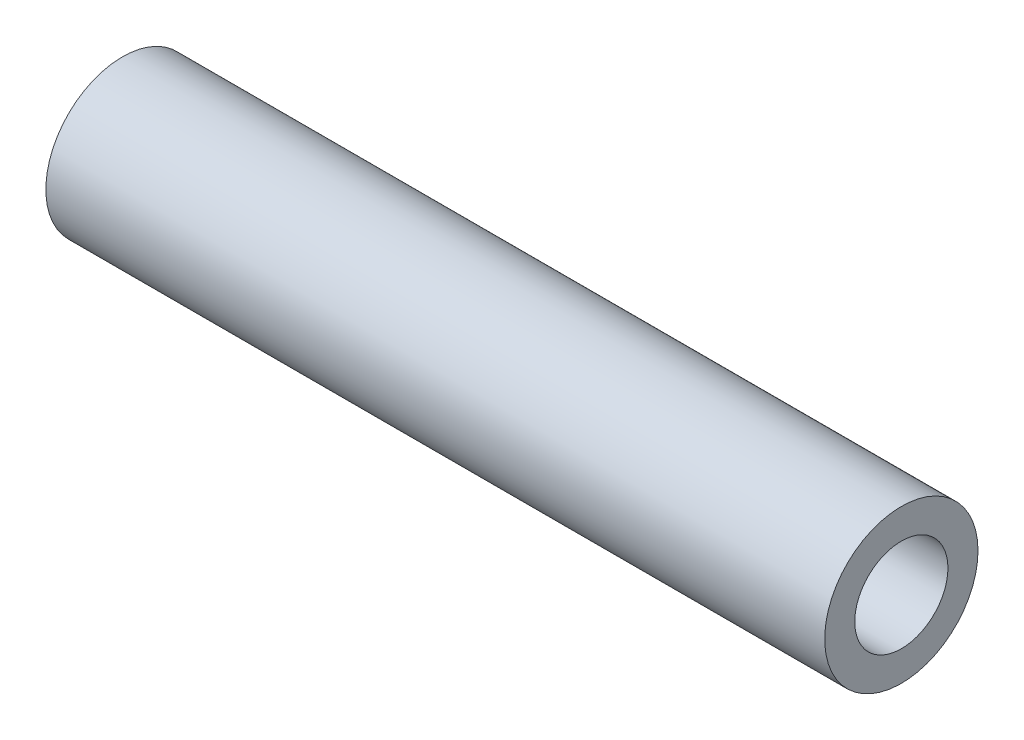
ISO-10303-21;
HEADER;
FILE_DESCRIPTION(('STEP AP214'),'2;1');
FILE_NAME('part.step','',(''),(''),'','','');
FILE_SCHEMA(('AUTOMOTIVE_DESIGN { 1 0 10303 214 1 1 1 1 }'));
ENDSEC;
DATA;
#1=APPLICATION_CONTEXT('core data for automotive mechanical design processes');
#2=APPLICATION_PROTOCOL_DEFINITION('international standard','automotive_design',2000,#1);
#3=PRODUCT_CONTEXT('',#1,'mechanical');
#4=PRODUCT('Part','Part','',(#3));
#5=PRODUCT_RELATED_PRODUCT_CATEGORY('part','',(#4));
#6=PRODUCT_DEFINITION_FORMATION('','',#4);
#7=PRODUCT_DEFINITION_CONTEXT('part definition',#1,'design');
#8=PRODUCT_DEFINITION('design','',#6,#7);
#9=PRODUCT_DEFINITION_SHAPE('','',#8);
#10=(LENGTH_UNIT() NAMED_UNIT(*) SI_UNIT(.MILLI.,.METRE.));
#11=(NAMED_UNIT(*) PLANE_ANGLE_UNIT() SI_UNIT($,.RADIAN.));
#12=(NAMED_UNIT(*) SI_UNIT($,.STERADIAN.) SOLID_ANGLE_UNIT());
#13=UNCERTAINTY_MEASURE_WITH_UNIT(LENGTH_MEASURE(1.E-05),#10,'distance_accuracy_value','');
#14=(GEOMETRIC_REPRESENTATION_CONTEXT(3) GLOBAL_UNCERTAINTY_ASSIGNED_CONTEXT((#13)) GLOBAL_UNIT_ASSIGNED_CONTEXT((#10,
#11,#12)) REPRESENTATION_CONTEXT('',''));
#15=CARTESIAN_POINT('',(0.,0.,0.));
#16=DIRECTION('',(0.,0.,1.));
#17=DIRECTION('',(1.,0.,0.));
#18=AXIS2_PLACEMENT_3D('',#15,#16,#17);
#19=CARTESIAN_POINT('',(16.129,0.,0.));
#20=DIRECTION('',(1.,0.,0.));
#21=DIRECTION('',(0.,0.,-1.));
#22=AXIS2_PLACEMENT_3D('',#19,#20,#21);
#23=PLANE('',#22);
#24=CARTESIAN_POINT('',(16.129,0.,0.));
#25=DIRECTION('',(1.,0.,0.));
#26=DIRECTION('',(0.,0.,-1.));
#27=AXIS2_PLACEMENT_3D('',#24,#25,#26);
#28=CIRCLE('',#27,3.175);
#29=CARTESIAN_POINT('',(16.129,0.,-3.175));
#30=VERTEX_POINT('',#29);
#31=EDGE_CURVE('E10',#30,#30,#28,.T.);
#32=ORIENTED_EDGE('',*,*,#31,.T.);
#33=EDGE_LOOP('',(#32));
#34=FACE_BOUND('',#33,.T.);
#35=CARTESIAN_POINT('',(16.129,0.,0.));
#36=DIRECTION('',(1.,0.,0.));
#37=DIRECTION('',(0.,0.,-1.));
#38=AXIS2_PLACEMENT_3D('',#35,#36,#37);
#39=CIRCLE('',#38,1.9304);
#40=CARTESIAN_POINT('',(16.129,0.,-1.9304));
#41=VERTEX_POINT('',#40);
#42=EDGE_CURVE('E48',#41,#41,#39,.T.);
#43=ORIENTED_EDGE('',*,*,#42,.F.);
#44=EDGE_LOOP('',(#43));
#45=FACE_BOUND('',#44,.T.);
#46=ADVANCED_FACE('F37',(#34,#45),#23,.T.);
#47=CARTESIAN_POINT('',(-16.129,0.,0.));
#48=DIRECTION('',(1.,0.,0.));
#49=DIRECTION('',(0.,0.,-1.));
#50=AXIS2_PLACEMENT_3D('',#47,#48,#49);
#51=PLANE('',#50);
#52=CARTESIAN_POINT('',(-16.129,0.,0.));
#53=DIRECTION('',(1.,0.,0.));
#54=DIRECTION('',(0.,0.,-1.));
#55=AXIS2_PLACEMENT_3D('',#52,#53,#54);
#56=CIRCLE('',#55,3.175);
#57=CARTESIAN_POINT('',(-16.129,0.,-3.175));
#58=VERTEX_POINT('',#57);
#59=EDGE_CURVE('E41',#58,#58,#56,.T.);
#60=ORIENTED_EDGE('',*,*,#59,.F.);
#61=EDGE_LOOP('',(#60));
#62=FACE_BOUND('',#61,.T.);
#63=CARTESIAN_POINT('',(-16.129,0.,0.));
#64=DIRECTION('',(1.,0.,0.));
#65=DIRECTION('',(0.,0.,-1.));
#66=AXIS2_PLACEMENT_3D('',#63,#64,#65);
#67=CIRCLE('',#66,1.9304);
#68=CARTESIAN_POINT('',(-16.129,0.,-1.9304));
#69=VERTEX_POINT('',#68);
#70=EDGE_CURVE('E50',#69,#69,#67,.T.);
#71=ORIENTED_EDGE('',*,*,#70,.T.);
#72=EDGE_LOOP('',(#71));
#73=FACE_BOUND('',#72,.T.);
#74=ADVANCED_FACE('F60',(#62,#73),#51,.F.);
#75=CARTESIAN_POINT('',(16.129,0.,0.));
#76=DIRECTION('',(-1.,0.,0.));
#77=DIRECTION('',(0.,0.,1.));
#78=AXIS2_PLACEMENT_3D('',#75,#76,#77);
#79=CYLINDRICAL_SURFACE('',#78,3.175);
#80=ORIENTED_EDGE('',*,*,#31,.F.);
#81=EDGE_LOOP('',(#80));
#82=FACE_BOUND('',#81,.T.);
#83=ORIENTED_EDGE('',*,*,#59,.T.);
#84=EDGE_LOOP('',(#83));
#85=FACE_BOUND('',#84,.T.);
#86=ADVANCED_FACE('F39',(#82,#85),#79,.T.);
#87=CARTESIAN_POINT('',(16.129,0.,0.));
#88=DIRECTION('',(-1.,0.,0.));
#89=DIRECTION('',(0.,0.,1.));
#90=AXIS2_PLACEMENT_3D('',#87,#88,#89);
#91=CYLINDRICAL_SURFACE('',#90,1.9304);
#92=ORIENTED_EDGE('',*,*,#42,.T.);
#93=EDGE_LOOP('',(#92));
#94=FACE_BOUND('',#93,.T.);
#95=ORIENTED_EDGE('',*,*,#70,.F.);
#96=EDGE_LOOP('',(#95));
#97=FACE_BOUND('',#96,.T.);
#98=ADVANCED_FACE('F56',(#94,#97),#91,.F.);
#99=CLOSED_SHELL('',(#46,#74,#86,#98));
#100=MANIFOLD_SOLID_BREP('B2',#99);
#101=ADVANCED_BREP_SHAPE_REPRESENTATION('',(#18,#100),#14);
#102=SHAPE_DEFINITION_REPRESENTATION(#9,#101);
ENDSEC;
END-ISO-10303-21;
